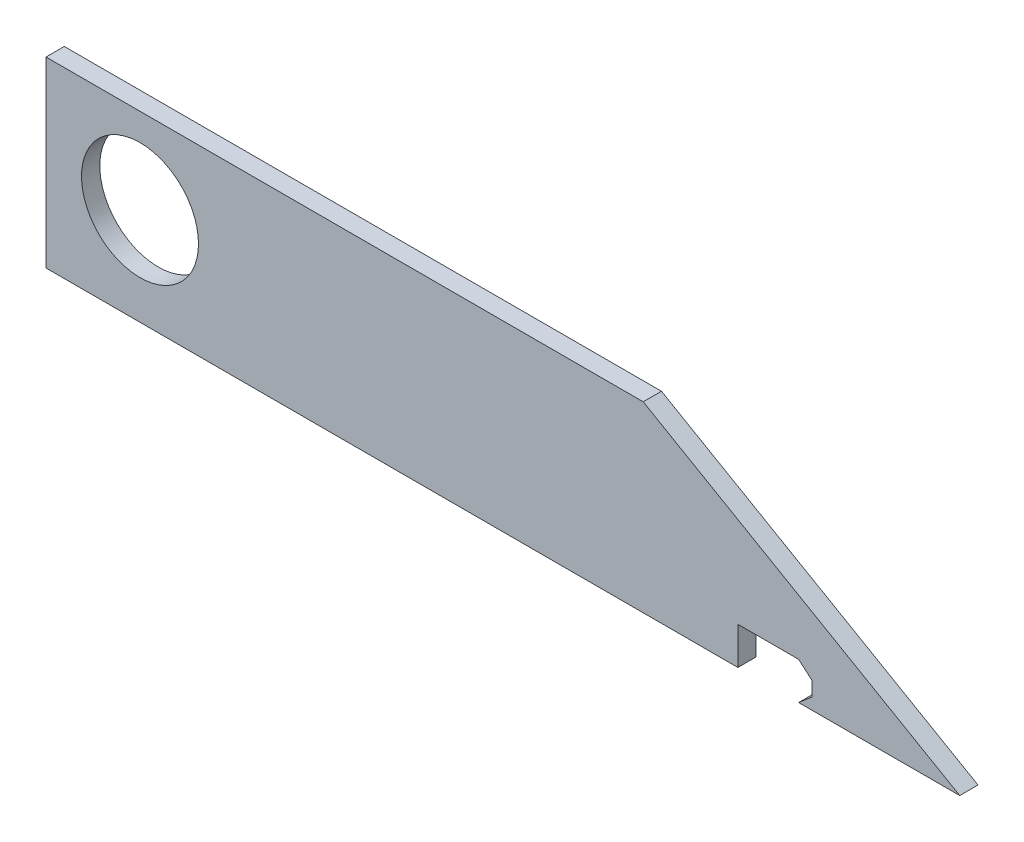
ISO-10303-21;
HEADER;
FILE_DESCRIPTION(('STEP AP214'),'2;1');
FILE_NAME('part.step','',(''),(''),'','','');
FILE_SCHEMA(('AUTOMOTIVE_DESIGN { 1 0 10303 214 1 1 1 1 }'));
ENDSEC;
DATA;
#1=APPLICATION_CONTEXT('core data for automotive mechanical design processes');
#2=APPLICATION_PROTOCOL_DEFINITION('international standard','automotive_design',2000,#1);
#3=PRODUCT_CONTEXT('',#1,'mechanical');
#4=PRODUCT('Part','Part','',(#3));
#5=PRODUCT_RELATED_PRODUCT_CATEGORY('part','',(#4));
#6=PRODUCT_DEFINITION_FORMATION('','',#4);
#7=PRODUCT_DEFINITION_CONTEXT('part definition',#1,'design');
#8=PRODUCT_DEFINITION('design','',#6,#7);
#9=PRODUCT_DEFINITION_SHAPE('','',#8);
#10=(LENGTH_UNIT() NAMED_UNIT(*) SI_UNIT(.MILLI.,.METRE.));
#11=(NAMED_UNIT(*) PLANE_ANGLE_UNIT() SI_UNIT($,.RADIAN.));
#12=(NAMED_UNIT(*) SI_UNIT($,.STERADIAN.) SOLID_ANGLE_UNIT());
#13=UNCERTAINTY_MEASURE_WITH_UNIT(LENGTH_MEASURE(1.E-05),#10,'distance_accuracy_value','');
#14=(GEOMETRIC_REPRESENTATION_CONTEXT(3) GLOBAL_UNCERTAINTY_ASSIGNED_CONTEXT((#13)) GLOBAL_UNIT_ASSIGNED_CONTEXT((#10,
#11,#12)) REPRESENTATION_CONTEXT('',''));
#15=CARTESIAN_POINT('',(0.,0.,0.));
#16=DIRECTION('',(0.,0.,1.));
#17=DIRECTION('',(1.,0.,0.));
#18=AXIS2_PLACEMENT_3D('',#15,#16,#17);
#19=CARTESIAN_POINT('',(-63.5,2.4,-2.54));
#20=DIRECTION('',(0.,-1.,0.));
#21=DIRECTION('',(0.,0.,-1.));
#22=AXIS2_PLACEMENT_3D('',#19,#20,#21);
#23=PLANE('',#22);
#24=DIRECTION('',(0.,0.,-1.));
#25=VECTOR('',#24,1.);
#26=CARTESIAN_POINT('',(32.6673422724126,2.4,0.));
#27=LINE('',#26,#25);
#28=CARTESIAN_POINT('',(32.6673422724126,2.4,0.));
#29=VERTEX_POINT('',#28);
#30=CARTESIAN_POINT('',(32.6673422724126,2.4,-2.54));
#31=VERTEX_POINT('',#30);
#32=EDGE_CURVE('E164',#29,#31,#27,.T.);
#33=ORIENTED_EDGE('',*,*,#32,.F.);
#34=DIRECTION('',(1.,0.,0.));
#35=VECTOR('',#34,1.);
#36=CARTESIAN_POINT('',(-63.5,2.4,0.));
#37=LINE('',#36,#35);
#38=CARTESIAN_POINT('',(-63.5,2.4,0.));
#39=VERTEX_POINT('',#38);
#40=EDGE_CURVE('E190',#39,#29,#37,.T.);
#41=ORIENTED_EDGE('',*,*,#40,.F.);
#42=DIRECTION('',(0.,0.,1.));
#43=VECTOR('',#42,1.);
#44=CARTESIAN_POINT('',(-63.5,2.4,-2.54));
#45=LINE('',#44,#43);
#46=CARTESIAN_POINT('',(-63.5,2.4,-2.54));
#47=VERTEX_POINT('',#46);
#48=EDGE_CURVE('E38',#47,#39,#45,.T.);
#49=ORIENTED_EDGE('',*,*,#48,.F.);
#50=DIRECTION('',(1.,0.,0.));
#51=VECTOR('',#50,1.);
#52=CARTESIAN_POINT('',(-63.5,2.4,-2.54));
#53=LINE('',#52,#51);
#54=EDGE_CURVE('E180',#47,#31,#53,.T.);
#55=ORIENTED_EDGE('',*,*,#54,.T.);
#56=EDGE_LOOP('',(#33,#41,#49,#55));
#57=FACE_BOUND('',#56,.T.);
#58=ADVANCED_FACE('F34',(#57),#23,.T.);
#59=CARTESIAN_POINT('',(-63.5,27.8,-2.54));
#60=DIRECTION('',(-1.,0.,0.));
#61=DIRECTION('',(0.,0.,1.));
#62=AXIS2_PLACEMENT_3D('',#59,#60,#61);
#63=PLANE('',#62);
#64=DIRECTION('',(0.,-1.,0.));
#65=VECTOR('',#64,1.);
#66=CARTESIAN_POINT('',(-63.5,27.8,0.));
#67=LINE('',#66,#65);
#68=CARTESIAN_POINT('',(-63.5,27.8,0.));
#69=VERTEX_POINT('',#68);
#70=EDGE_CURVE('E173',#69,#39,#67,.T.);
#71=ORIENTED_EDGE('',*,*,#70,.F.);
#72=DIRECTION('',(0.,0.,1.));
#73=VECTOR('',#72,1.);
#74=CARTESIAN_POINT('',(-63.5,27.8,-2.54));
#75=LINE('',#74,#73);
#76=CARTESIAN_POINT('',(-63.5,27.8,-2.54));
#77=VERTEX_POINT('',#76);
#78=EDGE_CURVE('E11',#77,#69,#75,.T.);
#79=ORIENTED_EDGE('',*,*,#78,.F.);
#80=DIRECTION('',(0.,-1.,0.));
#81=VECTOR('',#80,1.);
#82=CARTESIAN_POINT('',(-63.5,27.8,-2.54));
#83=LINE('',#82,#81);
#84=EDGE_CURVE('E176',#77,#47,#83,.T.);
#85=ORIENTED_EDGE('',*,*,#84,.T.);
#86=ORIENTED_EDGE('',*,*,#48,.T.);
#87=EDGE_LOOP('',(#71,#79,#85,#86));
#88=FACE_BOUND('',#87,.T.);
#89=ADVANCED_FACE('F36',(#88),#63,.T.);
#90=CARTESIAN_POINT('',(19.5059094877499,27.8,-2.54));
#91=DIRECTION('',(0.,1.,0.));
#92=DIRECTION('',(-1.,0.,0.));
#93=AXIS2_PLACEMENT_3D('',#90,#91,#92);
#94=PLANE('',#93);
#95=DIRECTION('',(-1.,0.,0.));
#96=VECTOR('',#95,1.);
#97=CARTESIAN_POINT('',(19.5059094877499,27.8,0.));
#98=LINE('',#97,#96);
#99=CARTESIAN_POINT('',(19.5059094877499,27.8,0.));
#100=VERTEX_POINT('',#99);
#101=EDGE_CURVE('E179',#100,#69,#98,.T.);
#102=ORIENTED_EDGE('',*,*,#101,.F.);
#103=DIRECTION('',(0.,0.,1.));
#104=VECTOR('',#103,1.);
#105=CARTESIAN_POINT('',(19.5059094877499,27.8,-2.54));
#106=LINE('',#105,#104);
#107=CARTESIAN_POINT('',(19.5059094877499,27.8,-2.54));
#108=VERTEX_POINT('',#107);
#109=EDGE_CURVE('E43',#108,#100,#106,.T.);
#110=ORIENTED_EDGE('',*,*,#109,.F.);
#111=DIRECTION('',(-1.,0.,0.));
#112=VECTOR('',#111,1.);
#113=CARTESIAN_POINT('',(19.5059094877499,27.8,-2.54));
#114=LINE('',#113,#112);
#115=EDGE_CURVE('E185',#108,#77,#114,.T.);
#116=ORIENTED_EDGE('',*,*,#115,.T.);
#117=ORIENTED_EDGE('',*,*,#78,.T.);
#118=EDGE_LOOP('',(#102,#110,#116,#117));
#119=FACE_BOUND('',#118,.T.);
#120=ADVANCED_FACE('F205',(#119),#94,.T.);
#121=CARTESIAN_POINT('',(63.5,2.4,-2.54));
#122=DIRECTION('',(0.499999999999995,0.866025403784442,0.));
#123=DIRECTION('',(-0.866025403784442,0.499999999999995,0.));
#124=AXIS2_PLACEMENT_3D('',#121,#122,#123);
#125=PLANE('',#124);
#126=DIRECTION('',(-0.866025403784442,0.499999999999995,0.));
#127=VECTOR('',#126,1.);
#128=CARTESIAN_POINT('',(63.5,2.4,0.));
#129=LINE('',#128,#127);
#130=CARTESIAN_POINT('',(63.5,2.4,0.));
#131=VERTEX_POINT('',#130);
#132=EDGE_CURVE('E193',#131,#100,#129,.T.);
#133=ORIENTED_EDGE('',*,*,#132,.F.);
#134=DIRECTION('',(0.,0.,1.));
#135=VECTOR('',#134,1.);
#136=CARTESIAN_POINT('',(63.5,2.4,-2.54));
#137=LINE('',#136,#135);
#138=CARTESIAN_POINT('',(63.5,2.4,-2.54));
#139=VERTEX_POINT('',#138);
#140=EDGE_CURVE('E198',#139,#131,#137,.T.);
#141=ORIENTED_EDGE('',*,*,#140,.F.);
#142=DIRECTION('',(-0.866025403784442,0.499999999999995,0.));
#143=VECTOR('',#142,1.);
#144=CARTESIAN_POINT('',(63.5,2.4,-2.54));
#145=LINE('',#144,#143);
#146=EDGE_CURVE('E182',#139,#108,#145,.T.);
#147=ORIENTED_EDGE('',*,*,#146,.T.);
#148=ORIENTED_EDGE('',*,*,#109,.T.);
#149=EDGE_LOOP('',(#133,#141,#147,#148));
#150=FACE_BOUND('',#149,.T.);
#151=ADVANCED_FACE('F209',(#150),#125,.T.);
#152=DIRECTION('',(0.,0.,-1.));
#153=VECTOR('',#152,1.);
#154=CARTESIAN_POINT('',(41.1054034310587,2.4,0.));
#155=LINE('',#154,#153);
#156=CARTESIAN_POINT('',(41.1054034310587,2.4,0.));
#157=VERTEX_POINT('',#156);
#158=CARTESIAN_POINT('',(41.1054034310587,2.4,-2.54));
#159=VERTEX_POINT('',#158);
#160=EDGE_CURVE('E166',#157,#159,#155,.T.);
#161=ORIENTED_EDGE('',*,*,#160,.T.);
#162=EDGE_CURVE('E178',#159,#139,#53,.T.);
#163=ORIENTED_EDGE('',*,*,#162,.T.);
#164=ORIENTED_EDGE('',*,*,#140,.T.);
#165=EDGE_CURVE('E189',#157,#131,#37,.T.);
#166=ORIENTED_EDGE('',*,*,#165,.F.);
#167=EDGE_LOOP('',(#161,#163,#164,#166));
#168=FACE_BOUND('',#167,.T.);
#169=ADVANCED_FACE('F221',(#168),#23,.T.);
#170=CARTESIAN_POINT('',(0.,0.,-2.54));
#171=DIRECTION('',(0.,0.,1.));
#172=DIRECTION('',(1.,0.,0.));
#173=AXIS2_PLACEMENT_3D('',#170,#171,#172);
#174=PLANE('',#173);
#175=CARTESIAN_POINT('',(-50.4347751341225,15.9060725287787,-2.54));
#176=DIRECTION('',(0.,0.,1.));
#177=DIRECTION('',(1.,0.,0.));
#178=AXIS2_PLACEMENT_3D('',#175,#176,#177);
#179=CIRCLE('',#178,8.128);
#180=CARTESIAN_POINT('',(-42.3067751341225,15.9060725287787,-2.54));
#181=VERTEX_POINT('',#180);
#182=EDGE_CURVE('E170',#181,#181,#179,.T.);
#183=ORIENTED_EDGE('',*,*,#182,.T.);
#184=EDGE_LOOP('',(#183));
#185=FACE_BOUND('',#184,.T.);
#186=DIRECTION('',(1.,0.,0.));
#187=VECTOR('',#186,1.);
#188=CARTESIAN_POINT('',(41.1054034310587,7.6,-2.54));
#189=LINE('',#188,#187);
#190=CARTESIAN_POINT('',(32.6673422724126,7.6,-2.54));
#191=VERTEX_POINT('',#190);
#192=CARTESIAN_POINT('',(41.1054034310587,7.6,-2.54));
#193=VERTEX_POINT('',#192);
#194=EDGE_CURVE('E142',#191,#193,#189,.T.);
#195=ORIENTED_EDGE('',*,*,#194,.F.);
#196=DIRECTION('',(0.,1.,0.));
#197=VECTOR('',#196,1.);
#198=CARTESIAN_POINT('',(32.6673422724126,7.6,-2.54));
#199=LINE('',#198,#197);
#200=EDGE_CURVE('E145',#31,#191,#199,.T.);
#201=ORIENTED_EDGE('',*,*,#200,.F.);
#202=ORIENTED_EDGE('',*,*,#54,.F.);
#203=ORIENTED_EDGE('',*,*,#84,.F.);
#204=ORIENTED_EDGE('',*,*,#115,.F.);
#205=ORIENTED_EDGE('',*,*,#146,.F.);
#206=ORIENTED_EDGE('',*,*,#162,.F.);
#207=DIRECTION('',(-0.758440361342967,-0.651742447816582,0.));
#208=VECTOR('',#207,1.);
#209=CARTESIAN_POINT('',(41.1054034310587,2.4,-2.54));
#210=LINE('',#209,#208);
#211=CARTESIAN_POINT('',(42.9673422724126,4.,-2.54));
#212=VERTEX_POINT('',#211);
#213=EDGE_CURVE('E155',#212,#159,#210,.T.);
#214=ORIENTED_EDGE('',*,*,#213,.F.);
#215=DIRECTION('',(0.,-1.,0.));
#216=VECTOR('',#215,1.);
#217=CARTESIAN_POINT('',(42.9673422724126,4.,-2.54));
#218=LINE('',#217,#216);
#219=CARTESIAN_POINT('',(42.9673422724126,6.,-2.54));
#220=VERTEX_POINT('',#219);
#221=EDGE_CURVE('E153',#220,#212,#218,.T.);
#222=ORIENTED_EDGE('',*,*,#221,.F.);
#223=DIRECTION('',(0.758440361342967,-0.651742447816582,0.));
#224=VECTOR('',#223,1.);
#225=CARTESIAN_POINT('',(42.9673422724126,6.,-2.54));
#226=LINE('',#225,#224);
#227=EDGE_CURVE('E126',#193,#220,#226,.T.);
#228=ORIENTED_EDGE('',*,*,#227,.F.);
#229=EDGE_LOOP('',(#195,#201,#202,#203,#204,#205,#206,#214,#222,#228));
#230=FACE_BOUND('',#229,.T.);
#231=ADVANCED_FACE('F213',(#185,#230),#174,.F.);
#232=CARTESIAN_POINT('',(0.,0.,0.));
#233=DIRECTION('',(0.,0.,1.));
#234=DIRECTION('',(1.,0.,0.));
#235=AXIS2_PLACEMENT_3D('',#232,#233,#234);
#236=PLANE('',#235);
#237=DIRECTION('',(0.,1.,0.));
#238=VECTOR('',#237,1.);
#239=CARTESIAN_POINT('',(32.6673422724126,7.6,0.));
#240=LINE('',#239,#238);
#241=CARTESIAN_POINT('',(32.6673422724126,7.6,0.));
#242=VERTEX_POINT('',#241);
#243=EDGE_CURVE('E149',#29,#242,#240,.T.);
#244=ORIENTED_EDGE('',*,*,#243,.T.);
#245=DIRECTION('',(1.,0.,0.));
#246=VECTOR('',#245,1.);
#247=CARTESIAN_POINT('',(41.1054034310587,7.6,0.));
#248=LINE('',#247,#246);
#249=CARTESIAN_POINT('',(41.1054034310587,7.6,0.));
#250=VERTEX_POINT('',#249);
#251=EDGE_CURVE('E131',#242,#250,#248,.T.);
#252=ORIENTED_EDGE('',*,*,#251,.T.);
#253=DIRECTION('',(0.758440361342967,-0.651742447816582,0.));
#254=VECTOR('',#253,1.);
#255=CARTESIAN_POINT('',(42.9673422724126,6.,0.));
#256=LINE('',#255,#254);
#257=CARTESIAN_POINT('',(42.9673422724126,6.,0.));
#258=VERTEX_POINT('',#257);
#259=EDGE_CURVE('E123',#250,#258,#256,.T.);
#260=ORIENTED_EDGE('',*,*,#259,.T.);
#261=DIRECTION('',(0.,-1.,0.));
#262=VECTOR('',#261,1.);
#263=CARTESIAN_POINT('',(42.9673422724126,4.,0.));
#264=LINE('',#263,#262);
#265=CARTESIAN_POINT('',(42.9673422724126,4.,0.));
#266=VERTEX_POINT('',#265);
#267=EDGE_CURVE('E134',#258,#266,#264,.T.);
#268=ORIENTED_EDGE('',*,*,#267,.T.);
#269=DIRECTION('',(-0.758440361342967,-0.651742447816582,0.));
#270=VECTOR('',#269,1.);
#271=CARTESIAN_POINT('',(41.1054034310587,2.4,0.));
#272=LINE('',#271,#270);
#273=EDGE_CURVE('E51',#266,#157,#272,.T.);
#274=ORIENTED_EDGE('',*,*,#273,.T.);
#275=ORIENTED_EDGE('',*,*,#165,.T.);
#276=ORIENTED_EDGE('',*,*,#132,.T.);
#277=ORIENTED_EDGE('',*,*,#101,.T.);
#278=ORIENTED_EDGE('',*,*,#70,.T.);
#279=ORIENTED_EDGE('',*,*,#40,.T.);
#280=EDGE_LOOP('',(#244,#252,#260,#268,#274,#275,#276,#277,#278,#279));
#281=FACE_BOUND('',#280,.T.);
#282=CARTESIAN_POINT('',(-50.4347751341225,15.9060725287787,0.));
#283=DIRECTION('',(0.,0.,1.));
#284=DIRECTION('',(1.,0.,0.));
#285=AXIS2_PLACEMENT_3D('',#282,#283,#284);
#286=CIRCLE('',#285,8.128);
#287=CARTESIAN_POINT('',(-42.3067751341225,15.9060725287787,0.));
#288=VERTEX_POINT('',#287);
#289=EDGE_CURVE('E161',#288,#288,#286,.T.);
#290=ORIENTED_EDGE('',*,*,#289,.F.);
#291=EDGE_LOOP('',(#290));
#292=FACE_BOUND('',#291,.T.);
#293=ADVANCED_FACE('F139',(#281,#292),#236,.T.);
#294=CARTESIAN_POINT('',(-50.4347751341225,15.9060725287787,-2.54));
#295=DIRECTION('',(0.,0.,1.));
#296=DIRECTION('',(1.,0.,0.));
#297=AXIS2_PLACEMENT_3D('',#294,#295,#296);
#298=CYLINDRICAL_SURFACE('',#297,8.128);
#299=ORIENTED_EDGE('',*,*,#182,.F.);
#300=EDGE_LOOP('',(#299));
#301=FACE_BOUND('',#300,.T.);
#302=ORIENTED_EDGE('',*,*,#289,.T.);
#303=EDGE_LOOP('',(#302));
#304=FACE_BOUND('',#303,.T.);
#305=ADVANCED_FACE('F242',(#301,#304),#298,.F.);
#306=CARTESIAN_POINT('',(42.9673422724126,6.,0.));
#307=DIRECTION('',(0.651742447816582,0.758440361342967,0.));
#308=DIRECTION('',(-0.758440361342967,0.651742447816582,0.));
#309=AXIS2_PLACEMENT_3D('',#306,#307,#308);
#310=PLANE('',#309);
#311=ORIENTED_EDGE('',*,*,#227,.T.);
#312=DIRECTION('',(0.,0.,-1.));
#313=VECTOR('',#312,1.);
#314=CARTESIAN_POINT('',(42.9673422724126,6.,0.));
#315=LINE('',#314,#313);
#316=EDGE_CURVE('E119',#258,#220,#315,.T.);
#317=ORIENTED_EDGE('',*,*,#316,.F.);
#318=ORIENTED_EDGE('',*,*,#259,.F.);
#319=DIRECTION('',(0.,0.,-1.));
#320=VECTOR('',#319,1.);
#321=CARTESIAN_POINT('',(41.1054034310587,7.6,0.));
#322=LINE('',#321,#320);
#323=EDGE_CURVE('E159',#250,#193,#322,.T.);
#324=ORIENTED_EDGE('',*,*,#323,.T.);
#325=EDGE_LOOP('',(#311,#317,#318,#324));
#326=FACE_BOUND('',#325,.T.);
#327=ADVANCED_FACE('F121',(#326),#310,.F.);
#328=CARTESIAN_POINT('',(41.1054034310587,7.6,0.));
#329=DIRECTION('',(0.,1.,0.));
#330=DIRECTION('',(0.,0.,1.));
#331=AXIS2_PLACEMENT_3D('',#328,#329,#330);
#332=PLANE('',#331);
#333=ORIENTED_EDGE('',*,*,#194,.T.);
#334=ORIENTED_EDGE('',*,*,#323,.F.);
#335=ORIENTED_EDGE('',*,*,#251,.F.);
#336=DIRECTION('',(0.,0.,-1.));
#337=VECTOR('',#336,1.);
#338=CARTESIAN_POINT('',(32.6673422724126,7.6,0.));
#339=LINE('',#338,#337);
#340=EDGE_CURVE('E162',#242,#191,#339,.T.);
#341=ORIENTED_EDGE('',*,*,#340,.T.);
#342=EDGE_LOOP('',(#333,#334,#335,#341));
#343=FACE_BOUND('',#342,.T.);
#344=ADVANCED_FACE('F218',(#343),#332,.F.);
#345=CARTESIAN_POINT('',(32.6673422724126,7.6,0.));
#346=DIRECTION('',(-1.,0.,0.));
#347=DIRECTION('',(0.,-1.,0.));
#348=AXIS2_PLACEMENT_3D('',#345,#346,#347);
#349=PLANE('',#348);
#350=ORIENTED_EDGE('',*,*,#200,.T.);
#351=ORIENTED_EDGE('',*,*,#340,.F.);
#352=ORIENTED_EDGE('',*,*,#243,.F.);
#353=ORIENTED_EDGE('',*,*,#32,.T.);
#354=EDGE_LOOP('',(#350,#351,#352,#353));
#355=FACE_BOUND('',#354,.T.);
#356=ADVANCED_FACE('F216',(#355),#349,.F.);
#357=CARTESIAN_POINT('',(41.1054034310587,2.4,0.));
#358=DIRECTION('',(0.651742447816582,-0.758440361342967,0.));
#359=DIRECTION('',(0.758440361342967,0.651742447816582,0.));
#360=AXIS2_PLACEMENT_3D('',#357,#358,#359);
#361=PLANE('',#360);
#362=ORIENTED_EDGE('',*,*,#213,.T.);
#363=ORIENTED_EDGE('',*,*,#160,.F.);
#364=ORIENTED_EDGE('',*,*,#273,.F.);
#365=DIRECTION('',(0.,0.,-1.));
#366=VECTOR('',#365,1.);
#367=CARTESIAN_POINT('',(42.9673422724126,4.,0.));
#368=LINE('',#367,#366);
#369=EDGE_CURVE('E130',#266,#212,#368,.T.);
#370=ORIENTED_EDGE('',*,*,#369,.T.);
#371=EDGE_LOOP('',(#362,#363,#364,#370));
#372=FACE_BOUND('',#371,.T.);
#373=ADVANCED_FACE('F220',(#372),#361,.F.);
#374=CARTESIAN_POINT('',(42.9673422724126,4.,0.));
#375=DIRECTION('',(1.,0.,0.));
#376=DIRECTION('',(0.,0.,-1.));
#377=AXIS2_PLACEMENT_3D('',#374,#375,#376);
#378=PLANE('',#377);
#379=ORIENTED_EDGE('',*,*,#221,.T.);
#380=ORIENTED_EDGE('',*,*,#369,.F.);
#381=ORIENTED_EDGE('',*,*,#267,.F.);
#382=ORIENTED_EDGE('',*,*,#316,.T.);
#383=EDGE_LOOP('',(#379,#380,#381,#382));
#384=FACE_BOUND('',#383,.T.);
#385=ADVANCED_FACE('F135',(#384),#378,.F.);
#386=CLOSED_SHELL('',(#58,#89,#120,#151,#169,#231,#293,#305,#327,#344,#356,#373,#385));
#387=MANIFOLD_SOLID_BREP('B2',#386);
#388=ADVANCED_BREP_SHAPE_REPRESENTATION('',(#18,#387),#14);
#389=SHAPE_DEFINITION_REPRESENTATION(#9,#388);
ENDSEC;
END-ISO-10303-21;
